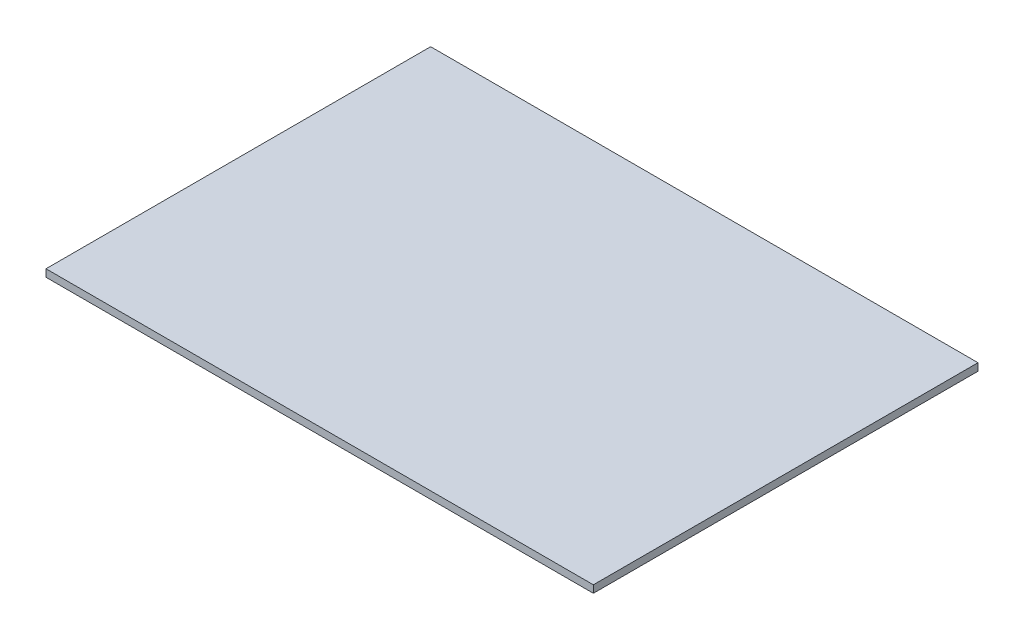
ISO-10303-21;
HEADER;
FILE_DESCRIPTION(('STEP AP214'),'2;1');
FILE_NAME('part.step','',(''),(''),'','','');
FILE_SCHEMA(('AUTOMOTIVE_DESIGN { 1 0 10303 214 1 1 1 1 }'));
ENDSEC;
DATA;
#1=APPLICATION_CONTEXT('core data for automotive mechanical design processes');
#2=APPLICATION_PROTOCOL_DEFINITION('international standard','automotive_design',2000,#1);
#3=PRODUCT_CONTEXT('',#1,'mechanical');
#4=PRODUCT('Part','Part','',(#3));
#5=PRODUCT_RELATED_PRODUCT_CATEGORY('part','',(#4));
#6=PRODUCT_DEFINITION_FORMATION('','',#4);
#7=PRODUCT_DEFINITION_CONTEXT('part definition',#1,'design');
#8=PRODUCT_DEFINITION('design','',#6,#7);
#9=PRODUCT_DEFINITION_SHAPE('','',#8);
#10=(LENGTH_UNIT() NAMED_UNIT(*) SI_UNIT(.MILLI.,.METRE.));
#11=(NAMED_UNIT(*) PLANE_ANGLE_UNIT() SI_UNIT($,.RADIAN.));
#12=(NAMED_UNIT(*) SI_UNIT($,.STERADIAN.) SOLID_ANGLE_UNIT());
#13=UNCERTAINTY_MEASURE_WITH_UNIT(LENGTH_MEASURE(1.E-05),#10,'distance_accuracy_value','');
#14=(GEOMETRIC_REPRESENTATION_CONTEXT(3) GLOBAL_UNCERTAINTY_ASSIGNED_CONTEXT((#13)) GLOBAL_UNIT_ASSIGNED_CONTEXT((#10,
#11,#12)) REPRESENTATION_CONTEXT('',''));
#15=CARTESIAN_POINT('',(0.,0.,0.));
#16=DIRECTION('',(0.,0.,1.));
#17=DIRECTION('',(1.,0.,0.));
#18=AXIS2_PLACEMENT_3D('',#15,#16,#17);
#19=CARTESIAN_POINT('',(185.,5.,-130.));
#20=DIRECTION('',(-1.,0.,0.));
#21=DIRECTION('',(0.,0.,1.));
#22=AXIS2_PLACEMENT_3D('',#19,#20,#21);
#23=PLANE('',#22);
#24=DIRECTION('',(0.,0.,-1.));
#25=VECTOR('',#24,1.);
#26=CARTESIAN_POINT('',(185.,0.,-130.));
#27=LINE('',#26,#25);
#28=CARTESIAN_POINT('',(185.,0.,130.));
#29=VERTEX_POINT('',#28);
#30=CARTESIAN_POINT('',(185.,0.,-130.));
#31=VERTEX_POINT('',#30);
#32=EDGE_CURVE('E118',#29,#31,#27,.T.);
#33=ORIENTED_EDGE('',*,*,#32,.T.);
#34=DIRECTION('',(0.,-1.,0.));
#35=VECTOR('',#34,1.);
#36=CARTESIAN_POINT('',(185.,5.,-130.));
#37=LINE('',#36,#35);
#38=CARTESIAN_POINT('',(185.,5.,-130.));
#39=VERTEX_POINT('',#38);
#40=EDGE_CURVE('E11',#39,#31,#37,.T.);
#41=ORIENTED_EDGE('',*,*,#40,.F.);
#42=DIRECTION('',(0.,0.,-1.));
#43=VECTOR('',#42,1.);
#44=CARTESIAN_POINT('',(185.,5.,-130.));
#45=LINE('',#44,#43);
#46=CARTESIAN_POINT('',(185.,5.,130.));
#47=VERTEX_POINT('',#46);
#48=EDGE_CURVE('E100',#47,#39,#45,.T.);
#49=ORIENTED_EDGE('',*,*,#48,.F.);
#50=DIRECTION('',(0.,-1.,0.));
#51=VECTOR('',#50,1.);
#52=CARTESIAN_POINT('',(185.,5.,130.));
#53=LINE('',#52,#51);
#54=EDGE_CURVE('E114',#47,#29,#53,.T.);
#55=ORIENTED_EDGE('',*,*,#54,.T.);
#56=EDGE_LOOP('',(#33,#41,#49,#55));
#57=FACE_BOUND('',#56,.T.);
#58=ADVANCED_FACE('F48',(#57),#23,.F.);
#59=CARTESIAN_POINT('',(-185.,5.,-130.));
#60=DIRECTION('',(0.,0.,1.));
#61=DIRECTION('',(1.,0.,0.));
#62=AXIS2_PLACEMENT_3D('',#59,#60,#61);
#63=PLANE('',#62);
#64=DIRECTION('',(-1.,0.,0.));
#65=VECTOR('',#64,1.);
#66=CARTESIAN_POINT('',(-185.,0.,-130.));
#67=LINE('',#66,#65);
#68=CARTESIAN_POINT('',(-185.,0.,-130.));
#69=VERTEX_POINT('',#68);
#70=EDGE_CURVE('E105',#31,#69,#67,.T.);
#71=ORIENTED_EDGE('',*,*,#70,.T.);
#72=DIRECTION('',(0.,-1.,0.));
#73=VECTOR('',#72,1.);
#74=CARTESIAN_POINT('',(-185.,5.,-130.));
#75=LINE('',#74,#73);
#76=CARTESIAN_POINT('',(-185.,5.,-130.));
#77=VERTEX_POINT('',#76);
#78=EDGE_CURVE('E57',#77,#69,#75,.T.);
#79=ORIENTED_EDGE('',*,*,#78,.F.);
#80=DIRECTION('',(-1.,0.,0.));
#81=VECTOR('',#80,1.);
#82=CARTESIAN_POINT('',(-185.,5.,-130.));
#83=LINE('',#82,#81);
#84=EDGE_CURVE('E95',#39,#77,#83,.T.);
#85=ORIENTED_EDGE('',*,*,#84,.F.);
#86=ORIENTED_EDGE('',*,*,#40,.T.);
#87=EDGE_LOOP('',(#71,#79,#85,#86));
#88=FACE_BOUND('',#87,.T.);
#89=ADVANCED_FACE('F104',(#88),#63,.F.);
#90=CARTESIAN_POINT('',(-185.,5.,-130.));
#91=DIRECTION('',(1.,0.,0.));
#92=DIRECTION('',(0.,0.,-1.));
#93=AXIS2_PLACEMENT_3D('',#90,#91,#92);
#94=PLANE('',#93);
#95=DIRECTION('',(0.,0.,1.));
#96=VECTOR('',#95,1.);
#97=CARTESIAN_POINT('',(-185.,0.,-130.));
#98=LINE('',#97,#96);
#99=CARTESIAN_POINT('',(-185.,0.,130.));
#100=VERTEX_POINT('',#99);
#101=EDGE_CURVE('E82',#69,#100,#98,.T.);
#102=ORIENTED_EDGE('',*,*,#101,.T.);
#103=DIRECTION('',(0.,-1.,0.));
#104=VECTOR('',#103,1.);
#105=CARTESIAN_POINT('',(-185.,5.,130.));
#106=LINE('',#105,#104);
#107=CARTESIAN_POINT('',(-185.,5.,130.));
#108=VERTEX_POINT('',#107);
#109=EDGE_CURVE('E107',#108,#100,#106,.T.);
#110=ORIENTED_EDGE('',*,*,#109,.F.);
#111=DIRECTION('',(0.,0.,1.));
#112=VECTOR('',#111,1.);
#113=CARTESIAN_POINT('',(-185.,5.,-130.));
#114=LINE('',#113,#112);
#115=EDGE_CURVE('E98',#77,#108,#114,.T.);
#116=ORIENTED_EDGE('',*,*,#115,.F.);
#117=ORIENTED_EDGE('',*,*,#78,.T.);
#118=EDGE_LOOP('',(#102,#110,#116,#117));
#119=FACE_BOUND('',#118,.T.);
#120=ADVANCED_FACE('F108',(#119),#94,.F.);
#121=CARTESIAN_POINT('',(-185.,5.,130.));
#122=DIRECTION('',(0.,0.,-1.));
#123=DIRECTION('',(-1.,0.,0.));
#124=AXIS2_PLACEMENT_3D('',#121,#122,#123);
#125=PLANE('',#124);
#126=DIRECTION('',(1.,0.,0.));
#127=VECTOR('',#126,1.);
#128=CARTESIAN_POINT('',(-185.,0.,130.));
#129=LINE('',#128,#127);
#130=EDGE_CURVE('E88',#100,#29,#129,.T.);
#131=ORIENTED_EDGE('',*,*,#130,.T.);
#132=ORIENTED_EDGE('',*,*,#54,.F.);
#133=DIRECTION('',(1.,0.,0.));
#134=VECTOR('',#133,1.);
#135=CARTESIAN_POINT('',(-185.,5.,130.));
#136=LINE('',#135,#134);
#137=EDGE_CURVE('E65',#108,#47,#136,.T.);
#138=ORIENTED_EDGE('',*,*,#137,.F.);
#139=ORIENTED_EDGE('',*,*,#109,.T.);
#140=EDGE_LOOP('',(#131,#132,#138,#139));
#141=FACE_BOUND('',#140,.T.);
#142=ADVANCED_FACE('F133',(#141),#125,.F.);
#143=CARTESIAN_POINT('',(0.,5.,0.));
#144=DIRECTION('',(0.,1.,0.));
#145=DIRECTION('',(0.,0.,1.));
#146=AXIS2_PLACEMENT_3D('',#143,#144,#145);
#147=PLANE('',#146);
#148=ORIENTED_EDGE('',*,*,#48,.T.);
#149=ORIENTED_EDGE('',*,*,#84,.T.);
#150=ORIENTED_EDGE('',*,*,#115,.T.);
#151=ORIENTED_EDGE('',*,*,#137,.T.);
#152=EDGE_LOOP('',(#148,#149,#150,#151));
#153=FACE_BOUND('',#152,.T.);
#154=ADVANCED_FACE('F96',(#153),#147,.T.);
#155=CARTESIAN_POINT('',(0.,0.,0.));
#156=DIRECTION('',(0.,1.,0.));
#157=DIRECTION('',(0.,0.,1.));
#158=AXIS2_PLACEMENT_3D('',#155,#156,#157);
#159=PLANE('',#158);
#160=ORIENTED_EDGE('',*,*,#32,.F.);
#161=ORIENTED_EDGE('',*,*,#130,.F.);
#162=ORIENTED_EDGE('',*,*,#101,.F.);
#163=ORIENTED_EDGE('',*,*,#70,.F.);
#164=EDGE_LOOP('',(#160,#161,#162,#163));
#165=FACE_BOUND('',#164,.T.);
#166=ADVANCED_FACE('F136',(#165),#159,.F.);
#167=CLOSED_SHELL('',(#58,#89,#120,#142,#154,#166));
#168=MANIFOLD_SOLID_BREP('B2',#167);
#169=ADVANCED_BREP_SHAPE_REPRESENTATION('',(#18,#168),#14);
#170=SHAPE_DEFINITION_REPRESENTATION(#9,#169);
ENDSEC;
END-ISO-10303-21;
